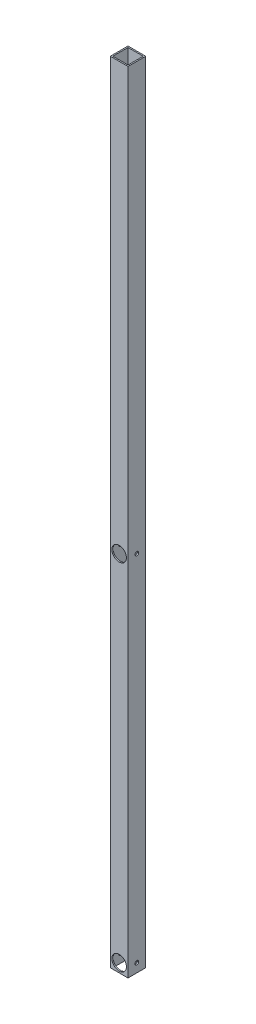
ISO-10303-21;
HEADER;
FILE_DESCRIPTION(('STEP AP214'),'2;1');
FILE_NAME('part.step','',(''),(''),'','','');
FILE_SCHEMA(('AUTOMOTIVE_DESIGN { 1 0 10303 214 1 1 1 1 }'));
ENDSEC;
DATA;
#1=APPLICATION_CONTEXT('core data for automotive mechanical design processes');
#2=APPLICATION_PROTOCOL_DEFINITION('international standard','automotive_design',2000,#1);
#3=PRODUCT_CONTEXT('',#1,'mechanical');
#4=PRODUCT('Part','Part','',(#3));
#5=PRODUCT_RELATED_PRODUCT_CATEGORY('part','',(#4));
#6=PRODUCT_DEFINITION_FORMATION('','',#4);
#7=PRODUCT_DEFINITION_CONTEXT('part definition',#1,'design');
#8=PRODUCT_DEFINITION('design','',#6,#7);
#9=PRODUCT_DEFINITION_SHAPE('','',#8);
#10=(LENGTH_UNIT() NAMED_UNIT(*) SI_UNIT(.MILLI.,.METRE.));
#11=(NAMED_UNIT(*) PLANE_ANGLE_UNIT() SI_UNIT($,.RADIAN.));
#12=(NAMED_UNIT(*) SI_UNIT($,.STERADIAN.) SOLID_ANGLE_UNIT());
#13=UNCERTAINTY_MEASURE_WITH_UNIT(LENGTH_MEASURE(1.E-05),#10,'distance_accuracy_value','');
#14=(GEOMETRIC_REPRESENTATION_CONTEXT(3) GLOBAL_UNCERTAINTY_ASSIGNED_CONTEXT((#13)) GLOBAL_UNIT_ASSIGNED_CONTEXT((#10,
#11,#12)) REPRESENTATION_CONTEXT('',''));
#15=CARTESIAN_POINT('',(0.,0.,0.));
#16=DIRECTION('',(0.,0.,1.));
#17=DIRECTION('',(1.,0.,0.));
#18=AXIS2_PLACEMENT_3D('',#15,#16,#17);
#19=CARTESIAN_POINT('',(0.,1981.2,0.));
#20=DIRECTION('',(0.,-1.,0.));
#21=DIRECTION('',(0.,0.,-1.));
#22=AXIS2_PLACEMENT_3D('',#19,#20,#21);
#23=PLANE('',#22);
#24=DIRECTION('',(0.,0.,1.));
#25=VECTOR('',#24,1.);
#26=CARTESIAN_POINT('',(0.,1981.2,0.));
#27=LINE('',#26,#25);
#28=CARTESIAN_POINT('',(0.,1981.2,-44.45));
#29=VERTEX_POINT('',#28);
#30=CARTESIAN_POINT('',(0.,1981.2,0.));
#31=VERTEX_POINT('',#30);
#32=EDGE_CURVE('E144',#29,#31,#27,.T.);
#33=ORIENTED_EDGE('',*,*,#32,.T.);
#34=DIRECTION('',(1.,0.,0.));
#35=VECTOR('',#34,1.);
#36=CARTESIAN_POINT('',(0.,1981.2,0.));
#37=LINE('',#36,#35);
#38=CARTESIAN_POINT('',(44.45,1981.2,0.));
#39=VERTEX_POINT('',#38);
#40=EDGE_CURVE('E147',#31,#39,#37,.T.);
#41=ORIENTED_EDGE('',*,*,#40,.T.);
#42=DIRECTION('',(0.,0.,-1.));
#43=VECTOR('',#42,1.);
#44=CARTESIAN_POINT('',(44.45,1981.2,0.));
#45=LINE('',#44,#43);
#46=CARTESIAN_POINT('',(44.45,1981.2,-44.45));
#47=VERTEX_POINT('',#46);
#48=EDGE_CURVE('E150',#39,#47,#45,.T.);
#49=ORIENTED_EDGE('',*,*,#48,.T.);
#50=DIRECTION('',(-1.,0.,0.));
#51=VECTOR('',#50,1.);
#52=CARTESIAN_POINT('',(0.,1981.2,-44.45));
#53=LINE('',#52,#51);
#54=EDGE_CURVE('E152',#47,#29,#53,.T.);
#55=ORIENTED_EDGE('',*,*,#54,.T.);
#56=EDGE_LOOP('',(#33,#41,#49,#55));
#57=FACE_BOUND('',#56,.T.);
#58=DIRECTION('',(1.,0.,0.));
#59=VECTOR('',#58,1.);
#60=CARTESIAN_POINT('',(3.175,1981.2,-3.175));
#61=LINE('',#60,#59);
#62=CARTESIAN_POINT('',(3.175,1981.2,-3.175));
#63=VERTEX_POINT('',#62);
#64=CARTESIAN_POINT('',(41.275,1981.2,-3.175));
#65=VERTEX_POINT('',#64);
#66=EDGE_CURVE('E106',#63,#65,#61,.T.);
#67=ORIENTED_EDGE('',*,*,#66,.F.);
#68=DIRECTION('',(0.,0.,1.));
#69=VECTOR('',#68,1.);
#70=CARTESIAN_POINT('',(3.175,1981.2,-3.175));
#71=LINE('',#70,#69);
#72=CARTESIAN_POINT('',(3.175,1981.2,-41.275));
#73=VERTEX_POINT('',#72);
#74=EDGE_CURVE('E128',#73,#63,#71,.T.);
#75=ORIENTED_EDGE('',*,*,#74,.F.);
#76=DIRECTION('',(-1.,0.,0.));
#77=VECTOR('',#76,1.);
#78=CARTESIAN_POINT('',(3.175,1981.2,-41.275));
#79=LINE('',#78,#77);
#80=CARTESIAN_POINT('',(41.275,1981.2,-41.275));
#81=VERTEX_POINT('',#80);
#82=EDGE_CURVE('E126',#81,#73,#79,.T.);
#83=ORIENTED_EDGE('',*,*,#82,.F.);
#84=DIRECTION('',(0.,0.,-1.));
#85=VECTOR('',#84,1.);
#86=CARTESIAN_POINT('',(41.275,1981.2,-3.175));
#87=LINE('',#86,#85);
#88=EDGE_CURVE('E114',#65,#81,#87,.T.);
#89=ORIENTED_EDGE('',*,*,#88,.F.);
#90=EDGE_LOOP('',(#67,#75,#83,#89));
#91=FACE_BOUND('',#90,.T.);
#92=ADVANCED_FACE('F39',(#57,#91),#23,.F.);
#93=CARTESIAN_POINT('',(0.,0.,0.));
#94=DIRECTION('',(0.,-1.,0.));
#95=DIRECTION('',(0.,0.,-1.));
#96=AXIS2_PLACEMENT_3D('',#93,#94,#95);
#97=PLANE('',#96);
#98=DIRECTION('',(0.,0.,1.));
#99=VECTOR('',#98,1.);
#100=CARTESIAN_POINT('',(0.,0.,0.));
#101=LINE('',#100,#99);
#102=CARTESIAN_POINT('',(0.,0.,-44.45));
#103=VERTEX_POINT('',#102);
#104=CARTESIAN_POINT('',(0.,0.,0.));
#105=VERTEX_POINT('',#104);
#106=EDGE_CURVE('E122',#103,#105,#101,.T.);
#107=ORIENTED_EDGE('',*,*,#106,.F.);
#108=DIRECTION('',(-1.,0.,0.));
#109=VECTOR('',#108,1.);
#110=CARTESIAN_POINT('',(0.,0.,-44.45));
#111=LINE('',#110,#109);
#112=CARTESIAN_POINT('',(44.45,0.,-44.45));
#113=VERTEX_POINT('',#112);
#114=EDGE_CURVE('E148',#113,#103,#111,.T.);
#115=ORIENTED_EDGE('',*,*,#114,.F.);
#116=DIRECTION('',(0.,0.,-1.));
#117=VECTOR('',#116,1.);
#118=CARTESIAN_POINT('',(44.45,0.,0.));
#119=LINE('',#118,#117);
#120=CARTESIAN_POINT('',(44.45,0.,0.));
#121=VERTEX_POINT('',#120);
#122=EDGE_CURVE('E159',#121,#113,#119,.T.);
#123=ORIENTED_EDGE('',*,*,#122,.F.);
#124=DIRECTION('',(1.,0.,0.));
#125=VECTOR('',#124,1.);
#126=CARTESIAN_POINT('',(0.,0.,0.));
#127=LINE('',#126,#125);
#128=EDGE_CURVE('E157',#105,#121,#127,.T.);
#129=ORIENTED_EDGE('',*,*,#128,.F.);
#130=EDGE_LOOP('',(#107,#115,#123,#129));
#131=FACE_BOUND('',#130,.T.);
#132=DIRECTION('',(0.,0.,1.));
#133=VECTOR('',#132,1.);
#134=CARTESIAN_POINT('',(3.175,0.,-3.175));
#135=LINE('',#134,#133);
#136=CARTESIAN_POINT('',(3.175,0.,-41.275));
#137=VERTEX_POINT('',#136);
#138=CARTESIAN_POINT('',(3.175,0.,-3.175));
#139=VERTEX_POINT('',#138);
#140=EDGE_CURVE('E115',#137,#139,#135,.T.);
#141=ORIENTED_EDGE('',*,*,#140,.T.);
#142=DIRECTION('',(1.,0.,0.));
#143=VECTOR('',#142,1.);
#144=CARTESIAN_POINT('',(3.175,0.,-3.175));
#145=LINE('',#144,#143);
#146=CARTESIAN_POINT('',(41.275,0.,-3.175));
#147=VERTEX_POINT('',#146);
#148=EDGE_CURVE('E64',#139,#147,#145,.T.);
#149=ORIENTED_EDGE('',*,*,#148,.T.);
#150=DIRECTION('',(0.,0.,-1.));
#151=VECTOR('',#150,1.);
#152=CARTESIAN_POINT('',(41.275,0.,-3.175));
#153=LINE('',#152,#151);
#154=CARTESIAN_POINT('',(41.275,0.,-41.275));
#155=VERTEX_POINT('',#154);
#156=EDGE_CURVE('E121',#147,#155,#153,.T.);
#157=ORIENTED_EDGE('',*,*,#156,.T.);
#158=DIRECTION('',(-1.,0.,0.));
#159=VECTOR('',#158,1.);
#160=CARTESIAN_POINT('',(3.175,0.,-41.275));
#161=LINE('',#160,#159);
#162=EDGE_CURVE('E136',#155,#137,#161,.T.);
#163=ORIENTED_EDGE('',*,*,#162,.T.);
#164=EDGE_LOOP('',(#141,#149,#157,#163));
#165=FACE_BOUND('',#164,.T.);
#166=ADVANCED_FACE('F247',(#131,#165),#97,.T.);
#167=CARTESIAN_POINT('',(0.,1981.2,0.));
#168=DIRECTION('',(1.,0.,0.));
#169=DIRECTION('',(0.,0.,-1.));
#170=AXIS2_PLACEMENT_3D('',#167,#168,#169);
#171=PLANE('',#170);
#172=CARTESIAN_POINT('',(0.,22.2249999999999,-22.225));
#173=DIRECTION('',(1.,0.,0.));
#174=DIRECTION('',(0.,0.,-1.));
#175=AXIS2_PLACEMENT_3D('',#172,#173,#174);
#176=CIRCLE('',#175,4.7625);
#177=CARTESIAN_POINT('',(0.,22.2249999999999,-26.9875));
#178=VERTEX_POINT('',#177);
#179=EDGE_CURVE('E179',#178,#178,#176,.T.);
#180=ORIENTED_EDGE('',*,*,#179,.T.);
#181=EDGE_LOOP('',(#180));
#182=FACE_BOUND('',#181,.T.);
#183=CARTESIAN_POINT('',(0.,911.225,-22.225));
#184=DIRECTION('',(1.,0.,0.));
#185=DIRECTION('',(0.,0.,-1.));
#186=AXIS2_PLACEMENT_3D('',#183,#184,#185);
#187=CIRCLE('',#186,4.76250000000002);
#188=CARTESIAN_POINT('',(0.,911.225,-26.9875));
#189=VERTEX_POINT('',#188);
#190=EDGE_CURVE('E190',#189,#189,#187,.T.);
#191=ORIENTED_EDGE('',*,*,#190,.T.);
#192=EDGE_LOOP('',(#191));
#193=FACE_BOUND('',#192,.T.);
#194=ORIENTED_EDGE('',*,*,#106,.T.);
#195=DIRECTION('',(0.,-1.,0.));
#196=VECTOR('',#195,1.);
#197=CARTESIAN_POINT('',(0.,1981.2,0.));
#198=LINE('',#197,#196);
#199=EDGE_CURVE('E11',#31,#105,#198,.T.);
#200=ORIENTED_EDGE('',*,*,#199,.F.);
#201=ORIENTED_EDGE('',*,*,#32,.F.);
#202=DIRECTION('',(0.,-1.,0.));
#203=VECTOR('',#202,1.);
#204=CARTESIAN_POINT('',(0.,1981.2,-44.45));
#205=LINE('',#204,#203);
#206=EDGE_CURVE('E154',#29,#103,#205,.T.);
#207=ORIENTED_EDGE('',*,*,#206,.T.);
#208=EDGE_LOOP('',(#194,#200,#201,#207));
#209=FACE_BOUND('',#208,.T.);
#210=ADVANCED_FACE('F41',(#182,#193,#209),#171,.F.);
#211=CARTESIAN_POINT('',(0.,1981.2,0.));
#212=DIRECTION('',(0.,0.,-1.));
#213=DIRECTION('',(-1.,0.,0.));
#214=AXIS2_PLACEMENT_3D('',#211,#212,#213);
#215=PLANE('',#214);
#216=CARTESIAN_POINT('',(22.225,22.2249999999999,0.));
#217=DIRECTION('',(0.,0.,1.));
#218=DIRECTION('',(1.,0.,0.));
#219=AXIS2_PLACEMENT_3D('',#216,#217,#218);
#220=CIRCLE('',#219,18.25625);
#221=CARTESIAN_POINT('',(40.48125,22.2249999999999,0.));
#222=VERTEX_POINT('',#221);
#223=EDGE_CURVE('E204',#222,#222,#220,.T.);
#224=ORIENTED_EDGE('',*,*,#223,.F.);
#225=EDGE_LOOP('',(#224));
#226=FACE_BOUND('',#225,.T.);
#227=CARTESIAN_POINT('',(22.225,911.225,0.));
#228=DIRECTION('',(0.,0.,1.));
#229=DIRECTION('',(1.,0.,0.));
#230=AXIS2_PLACEMENT_3D('',#227,#228,#229);
#231=CIRCLE('',#230,18.25625);
#232=CARTESIAN_POINT('',(40.48125,911.225,0.));
#233=VERTEX_POINT('',#232);
#234=EDGE_CURVE('E201',#233,#233,#231,.T.);
#235=ORIENTED_EDGE('',*,*,#234,.F.);
#236=EDGE_LOOP('',(#235));
#237=FACE_BOUND('',#236,.T.);
#238=ORIENTED_EDGE('',*,*,#128,.T.);
#239=DIRECTION('',(0.,-1.,0.));
#240=VECTOR('',#239,1.);
#241=CARTESIAN_POINT('',(44.45,1981.2,0.));
#242=LINE('',#241,#240);
#243=EDGE_CURVE('E48',#39,#121,#242,.T.);
#244=ORIENTED_EDGE('',*,*,#243,.F.);
#245=ORIENTED_EDGE('',*,*,#40,.F.);
#246=ORIENTED_EDGE('',*,*,#199,.T.);
#247=EDGE_LOOP('',(#238,#244,#245,#246));
#248=FACE_BOUND('',#247,.T.);
#249=ADVANCED_FACE('F233',(#226,#237,#248),#215,.F.);
#250=CARTESIAN_POINT('',(44.45,1981.2,0.));
#251=DIRECTION('',(-1.,0.,0.));
#252=DIRECTION('',(0.,0.,1.));
#253=AXIS2_PLACEMENT_3D('',#250,#251,#252);
#254=PLANE('',#253);
#255=CARTESIAN_POINT('',(44.45,22.2249999999999,-22.225));
#256=DIRECTION('',(1.,0.,0.));
#257=DIRECTION('',(0.,0.,-1.));
#258=AXIS2_PLACEMENT_3D('',#255,#256,#257);
#259=CIRCLE('',#258,4.7625);
#260=CARTESIAN_POINT('',(44.45,22.2249999999999,-26.9875));
#261=VERTEX_POINT('',#260);
#262=EDGE_CURVE('E185',#261,#261,#259,.T.);
#263=ORIENTED_EDGE('',*,*,#262,.F.);
#264=EDGE_LOOP('',(#263));
#265=FACE_BOUND('',#264,.T.);
#266=CARTESIAN_POINT('',(44.45,911.225,-22.225));
#267=DIRECTION('',(1.,0.,0.));
#268=DIRECTION('',(0.,0.,-1.));
#269=AXIS2_PLACEMENT_3D('',#266,#267,#268);
#270=CIRCLE('',#269,4.76250000000002);
#271=CARTESIAN_POINT('',(44.45,911.225,-26.9875));
#272=VERTEX_POINT('',#271);
#273=EDGE_CURVE('E195',#272,#272,#270,.T.);
#274=ORIENTED_EDGE('',*,*,#273,.F.);
#275=EDGE_LOOP('',(#274));
#276=FACE_BOUND('',#275,.T.);
#277=ORIENTED_EDGE('',*,*,#122,.T.);
#278=DIRECTION('',(0.,-1.,0.));
#279=VECTOR('',#278,1.);
#280=CARTESIAN_POINT('',(44.45,1981.2,-44.45));
#281=LINE('',#280,#279);
#282=EDGE_CURVE('E164',#47,#113,#281,.T.);
#283=ORIENTED_EDGE('',*,*,#282,.F.);
#284=ORIENTED_EDGE('',*,*,#48,.F.);
#285=ORIENTED_EDGE('',*,*,#243,.T.);
#286=EDGE_LOOP('',(#277,#283,#284,#285));
#287=FACE_BOUND('',#286,.T.);
#288=ADVANCED_FACE('F236',(#265,#276,#287),#254,.F.);
#289=CARTESIAN_POINT('',(0.,1981.2,-44.45));
#290=DIRECTION('',(0.,0.,1.));
#291=DIRECTION('',(1.,0.,0.));
#292=AXIS2_PLACEMENT_3D('',#289,#290,#291);
#293=PLANE('',#292);
#294=CARTESIAN_POINT('',(22.225,22.2249999999999,-44.45));
#295=DIRECTION('',(0.,0.,1.));
#296=DIRECTION('',(1.,0.,0.));
#297=AXIS2_PLACEMENT_3D('',#294,#295,#296);
#298=CIRCLE('',#297,18.25625);
#299=CARTESIAN_POINT('',(40.48125,22.2249999999999,-44.45));
#300=VERTEX_POINT('',#299);
#301=EDGE_CURVE('E173',#300,#300,#298,.T.);
#302=ORIENTED_EDGE('',*,*,#301,.T.);
#303=EDGE_LOOP('',(#302));
#304=FACE_BOUND('',#303,.T.);
#305=CARTESIAN_POINT('',(22.225,911.225,-44.45));
#306=DIRECTION('',(0.,0.,1.));
#307=DIRECTION('',(1.,0.,0.));
#308=AXIS2_PLACEMENT_3D('',#305,#306,#307);
#309=CIRCLE('',#308,18.25625);
#310=CARTESIAN_POINT('',(40.48125,911.225,-44.45));
#311=VERTEX_POINT('',#310);
#312=EDGE_CURVE('E207',#311,#311,#309,.T.);
#313=ORIENTED_EDGE('',*,*,#312,.T.);
#314=EDGE_LOOP('',(#313));
#315=FACE_BOUND('',#314,.T.);
#316=ORIENTED_EDGE('',*,*,#114,.T.);
#317=ORIENTED_EDGE('',*,*,#206,.F.);
#318=ORIENTED_EDGE('',*,*,#54,.F.);
#319=ORIENTED_EDGE('',*,*,#282,.T.);
#320=EDGE_LOOP('',(#316,#317,#318,#319));
#321=FACE_BOUND('',#320,.T.);
#322=ADVANCED_FACE('F221',(#304,#315,#321),#293,.F.);
#323=CARTESIAN_POINT('',(3.175,1981.2,-3.175));
#324=DIRECTION('',(0.,0.,-1.));
#325=DIRECTION('',(-1.,0.,0.));
#326=AXIS2_PLACEMENT_3D('',#323,#324,#325);
#327=PLANE('',#326);
#328=CARTESIAN_POINT('',(22.225,22.2249999999999,-3.175));
#329=DIRECTION('',(0.,0.,-1.));
#330=DIRECTION('',(-1.,0.,0.));
#331=AXIS2_PLACEMENT_3D('',#328,#329,#330);
#332=CIRCLE('',#331,18.25625);
#333=CARTESIAN_POINT('',(3.96875,22.2249999999999,-3.175));
#334=VERTEX_POINT('',#333);
#335=EDGE_CURVE('E134',#334,#334,#332,.T.);
#336=ORIENTED_EDGE('',*,*,#335,.F.);
#337=EDGE_LOOP('',(#336));
#338=FACE_BOUND('',#337,.T.);
#339=CARTESIAN_POINT('',(22.225,911.225,-3.175));
#340=DIRECTION('',(0.,0.,-1.));
#341=DIRECTION('',(-1.,0.,0.));
#342=AXIS2_PLACEMENT_3D('',#339,#340,#341);
#343=CIRCLE('',#342,18.25625);
#344=CARTESIAN_POINT('',(3.96874999999999,911.225,-3.175));
#345=VERTEX_POINT('',#344);
#346=EDGE_CURVE('E172',#345,#345,#343,.T.);
#347=ORIENTED_EDGE('',*,*,#346,.F.);
#348=EDGE_LOOP('',(#347));
#349=FACE_BOUND('',#348,.T.);
#350=ORIENTED_EDGE('',*,*,#148,.F.);
#351=DIRECTION('',(0.,-1.,0.));
#352=VECTOR('',#351,1.);
#353=CARTESIAN_POINT('',(3.175,1981.2,-3.175));
#354=LINE('',#353,#352);
#355=EDGE_CURVE('E110',#63,#139,#354,.T.);
#356=ORIENTED_EDGE('',*,*,#355,.F.);
#357=ORIENTED_EDGE('',*,*,#66,.T.);
#358=DIRECTION('',(0.,-1.,0.));
#359=VECTOR('',#358,1.);
#360=CARTESIAN_POINT('',(41.275,1981.2,-3.175));
#361=LINE('',#360,#359);
#362=EDGE_CURVE('E109',#65,#147,#361,.T.);
#363=ORIENTED_EDGE('',*,*,#362,.T.);
#364=EDGE_LOOP('',(#350,#356,#357,#363));
#365=FACE_BOUND('',#364,.T.);
#366=ADVANCED_FACE('F108',(#338,#349,#365),#327,.T.);
#367=CARTESIAN_POINT('',(41.275,1981.2,-3.175));
#368=DIRECTION('',(-1.,0.,0.));
#369=DIRECTION('',(0.,0.,1.));
#370=AXIS2_PLACEMENT_3D('',#367,#368,#369);
#371=PLANE('',#370);
#372=CARTESIAN_POINT('',(41.275,22.2249999999999,-22.225));
#373=DIRECTION('',(-1.,0.,0.));
#374=DIRECTION('',(0.,0.,1.));
#375=AXIS2_PLACEMENT_3D('',#372,#373,#374);
#376=CIRCLE('',#375,4.7625);
#377=CARTESIAN_POINT('',(41.275,22.2249999999999,-17.4625));
#378=VERTEX_POINT('',#377);
#379=EDGE_CURVE('E198',#378,#378,#376,.T.);
#380=ORIENTED_EDGE('',*,*,#379,.F.);
#381=EDGE_LOOP('',(#380));
#382=FACE_BOUND('',#381,.T.);
#383=CARTESIAN_POINT('',(41.275,911.225,-22.225));
#384=DIRECTION('',(-1.,0.,0.));
#385=DIRECTION('',(0.,0.,1.));
#386=AXIS2_PLACEMENT_3D('',#383,#384,#385);
#387=CIRCLE('',#386,4.76250000000002);
#388=CARTESIAN_POINT('',(41.275,911.225,-17.4625));
#389=VERTEX_POINT('',#388);
#390=EDGE_CURVE('E178',#389,#389,#387,.T.);
#391=ORIENTED_EDGE('',*,*,#390,.F.);
#392=EDGE_LOOP('',(#391));
#393=FACE_BOUND('',#392,.T.);
#394=ORIENTED_EDGE('',*,*,#156,.F.);
#395=ORIENTED_EDGE('',*,*,#362,.F.);
#396=ORIENTED_EDGE('',*,*,#88,.T.);
#397=DIRECTION('',(0.,-1.,0.));
#398=VECTOR('',#397,1.);
#399=CARTESIAN_POINT('',(41.275,1981.2,-41.275));
#400=LINE('',#399,#398);
#401=EDGE_CURVE('E123',#81,#155,#400,.T.);
#402=ORIENTED_EDGE('',*,*,#401,.T.);
#403=EDGE_LOOP('',(#394,#395,#396,#402));
#404=FACE_BOUND('',#403,.T.);
#405=ADVANCED_FACE('F118',(#382,#393,#404),#371,.T.);
#406=CARTESIAN_POINT('',(3.175,1981.2,-41.275));
#407=DIRECTION('',(0.,0.,1.));
#408=DIRECTION('',(1.,0.,0.));
#409=AXIS2_PLACEMENT_3D('',#406,#407,#408);
#410=PLANE('',#409);
#411=CARTESIAN_POINT('',(22.225,22.2249999999999,-41.275));
#412=DIRECTION('',(0.,0.,1.));
#413=DIRECTION('',(1.,0.,0.));
#414=AXIS2_PLACEMENT_3D('',#411,#412,#413);
#415=CIRCLE('',#414,18.25625);
#416=CARTESIAN_POINT('',(40.48125,22.2249999999999,-41.275));
#417=VERTEX_POINT('',#416);
#418=EDGE_CURVE('E174',#417,#417,#415,.T.);
#419=ORIENTED_EDGE('',*,*,#418,.F.);
#420=EDGE_LOOP('',(#419));
#421=FACE_BOUND('',#420,.T.);
#422=CARTESIAN_POINT('',(22.225,911.225,-41.275));
#423=DIRECTION('',(0.,0.,1.));
#424=DIRECTION('',(1.,0.,0.));
#425=AXIS2_PLACEMENT_3D('',#422,#423,#424);
#426=CIRCLE('',#425,18.25625);
#427=CARTESIAN_POINT('',(40.48125,911.225,-41.275));
#428=VERTEX_POINT('',#427);
#429=EDGE_CURVE('E169',#428,#428,#426,.T.);
#430=ORIENTED_EDGE('',*,*,#429,.F.);
#431=EDGE_LOOP('',(#430));
#432=FACE_BOUND('',#431,.T.);
#433=ORIENTED_EDGE('',*,*,#162,.F.);
#434=ORIENTED_EDGE('',*,*,#401,.F.);
#435=ORIENTED_EDGE('',*,*,#82,.T.);
#436=DIRECTION('',(0.,-1.,0.));
#437=VECTOR('',#436,1.);
#438=CARTESIAN_POINT('',(3.175,1981.2,-41.275));
#439=LINE('',#438,#437);
#440=EDGE_CURVE('E56',#73,#137,#439,.T.);
#441=ORIENTED_EDGE('',*,*,#440,.T.);
#442=EDGE_LOOP('',(#433,#434,#435,#441));
#443=FACE_BOUND('',#442,.T.);
#444=ADVANCED_FACE('F322',(#421,#432,#443),#410,.T.);
#445=CARTESIAN_POINT('',(3.175,1981.2,-3.175));
#446=DIRECTION('',(1.,0.,0.));
#447=DIRECTION('',(0.,0.,-1.));
#448=AXIS2_PLACEMENT_3D('',#445,#446,#447);
#449=PLANE('',#448);
#450=CARTESIAN_POINT('',(3.175,22.2249999999999,-22.225));
#451=DIRECTION('',(1.,0.,0.));
#452=DIRECTION('',(0.,0.,-1.));
#453=AXIS2_PLACEMENT_3D('',#450,#451,#452);
#454=CIRCLE('',#453,4.7625);
#455=CARTESIAN_POINT('',(3.175,22.2249999999999,-26.9875));
#456=VERTEX_POINT('',#455);
#457=EDGE_CURVE('E43',#456,#456,#454,.T.);
#458=ORIENTED_EDGE('',*,*,#457,.F.);
#459=EDGE_LOOP('',(#458));
#460=FACE_BOUND('',#459,.T.);
#461=CARTESIAN_POINT('',(3.175,911.225,-22.225));
#462=DIRECTION('',(1.,0.,0.));
#463=DIRECTION('',(0.,0.,-1.));
#464=AXIS2_PLACEMENT_3D('',#461,#462,#463);
#465=CIRCLE('',#464,4.76250000000002);
#466=CARTESIAN_POINT('',(3.175,911.225,-26.9875));
#467=VERTEX_POINT('',#466);
#468=EDGE_CURVE('E176',#467,#467,#465,.T.);
#469=ORIENTED_EDGE('',*,*,#468,.F.);
#470=EDGE_LOOP('',(#469));
#471=FACE_BOUND('',#470,.T.);
#472=ORIENTED_EDGE('',*,*,#140,.F.);
#473=ORIENTED_EDGE('',*,*,#440,.F.);
#474=ORIENTED_EDGE('',*,*,#74,.T.);
#475=ORIENTED_EDGE('',*,*,#355,.T.);
#476=EDGE_LOOP('',(#472,#473,#474,#475));
#477=FACE_BOUND('',#476,.T.);
#478=ADVANCED_FACE('F329',(#460,#471,#477),#449,.T.);
#479=CARTESIAN_POINT('',(22.225,911.225,-44.45));
#480=DIRECTION('',(0.,0.,1.));
#481=DIRECTION('',(1.,0.,0.));
#482=AXIS2_PLACEMENT_3D('',#479,#480,#481);
#483=CYLINDRICAL_SURFACE('',#482,18.25625);
#484=ORIENTED_EDGE('',*,*,#429,.T.);
#485=EDGE_LOOP('',(#484));
#486=FACE_BOUND('',#485,.T.);
#487=ORIENTED_EDGE('',*,*,#312,.F.);
#488=EDGE_LOOP('',(#487));
#489=FACE_BOUND('',#488,.T.);
#490=ADVANCED_FACE('F230',(#486,#489),#483,.F.);
#491=CARTESIAN_POINT('',(22.225,22.2249999999999,-44.45));
#492=DIRECTION('',(0.,0.,1.));
#493=DIRECTION('',(1.,0.,0.));
#494=AXIS2_PLACEMENT_3D('',#491,#492,#493);
#495=CYLINDRICAL_SURFACE('',#494,18.25625);
#496=ORIENTED_EDGE('',*,*,#418,.T.);
#497=EDGE_LOOP('',(#496));
#498=FACE_BOUND('',#497,.T.);
#499=ORIENTED_EDGE('',*,*,#301,.F.);
#500=EDGE_LOOP('',(#499));
#501=FACE_BOUND('',#500,.T.);
#502=ADVANCED_FACE('F228',(#498,#501),#495,.F.);
#503=ORIENTED_EDGE('',*,*,#346,.T.);
#504=EDGE_LOOP('',(#503));
#505=FACE_BOUND('',#504,.T.);
#506=ORIENTED_EDGE('',*,*,#234,.T.);
#507=EDGE_LOOP('',(#506));
#508=FACE_BOUND('',#507,.T.);
#509=ADVANCED_FACE('F225',(#505,#508),#483,.F.);
#510=ORIENTED_EDGE('',*,*,#335,.T.);
#511=EDGE_LOOP('',(#510));
#512=FACE_BOUND('',#511,.T.);
#513=ORIENTED_EDGE('',*,*,#223,.T.);
#514=EDGE_LOOP('',(#513));
#515=FACE_BOUND('',#514,.T.);
#516=ADVANCED_FACE('F216',(#512,#515),#495,.F.);
#517=CARTESIAN_POINT('',(0.,911.225,-22.225));
#518=DIRECTION('',(1.,0.,0.));
#519=DIRECTION('',(0.,0.,-1.));
#520=AXIS2_PLACEMENT_3D('',#517,#518,#519);
#521=CYLINDRICAL_SURFACE('',#520,4.76250000000002);
#522=ORIENTED_EDGE('',*,*,#468,.T.);
#523=EDGE_LOOP('',(#522));
#524=FACE_BOUND('',#523,.T.);
#525=ORIENTED_EDGE('',*,*,#190,.F.);
#526=EDGE_LOOP('',(#525));
#527=FACE_BOUND('',#526,.T.);
#528=ADVANCED_FACE('F280',(#524,#527),#521,.F.);
#529=CARTESIAN_POINT('',(0.,22.2249999999999,-22.225));
#530=DIRECTION('',(1.,0.,0.));
#531=DIRECTION('',(0.,0.,-1.));
#532=AXIS2_PLACEMENT_3D('',#529,#530,#531);
#533=CYLINDRICAL_SURFACE('',#532,4.7625);
#534=ORIENTED_EDGE('',*,*,#457,.T.);
#535=EDGE_LOOP('',(#534));
#536=FACE_BOUND('',#535,.T.);
#537=ORIENTED_EDGE('',*,*,#179,.F.);
#538=EDGE_LOOP('',(#537));
#539=FACE_BOUND('',#538,.T.);
#540=ADVANCED_FACE('F277',(#536,#539),#533,.F.);
#541=ORIENTED_EDGE('',*,*,#390,.T.);
#542=EDGE_LOOP('',(#541));
#543=FACE_BOUND('',#542,.T.);
#544=ORIENTED_EDGE('',*,*,#273,.T.);
#545=EDGE_LOOP('',(#544));
#546=FACE_BOUND('',#545,.T.);
#547=ADVANCED_FACE('F274',(#543,#546),#521,.F.);
#548=ORIENTED_EDGE('',*,*,#379,.T.);
#549=EDGE_LOOP('',(#548));
#550=FACE_BOUND('',#549,.T.);
#551=ORIENTED_EDGE('',*,*,#262,.T.);
#552=EDGE_LOOP('',(#551));
#553=FACE_BOUND('',#552,.T.);
#554=ADVANCED_FACE('F276',(#550,#553),#533,.F.);
#555=CLOSED_SHELL('',(#92,#166,#210,#249,#288,#322,#366,#405,#444,#478,#490,#502,#509,#516,#528,
#540,#547,#554));
#556=MANIFOLD_SOLID_BREP('B2',#555);
#557=ADVANCED_BREP_SHAPE_REPRESENTATION('',(#18,#556),#14);
#558=SHAPE_DEFINITION_REPRESENTATION(#9,#557);
ENDSEC;
END-ISO-10303-21;
